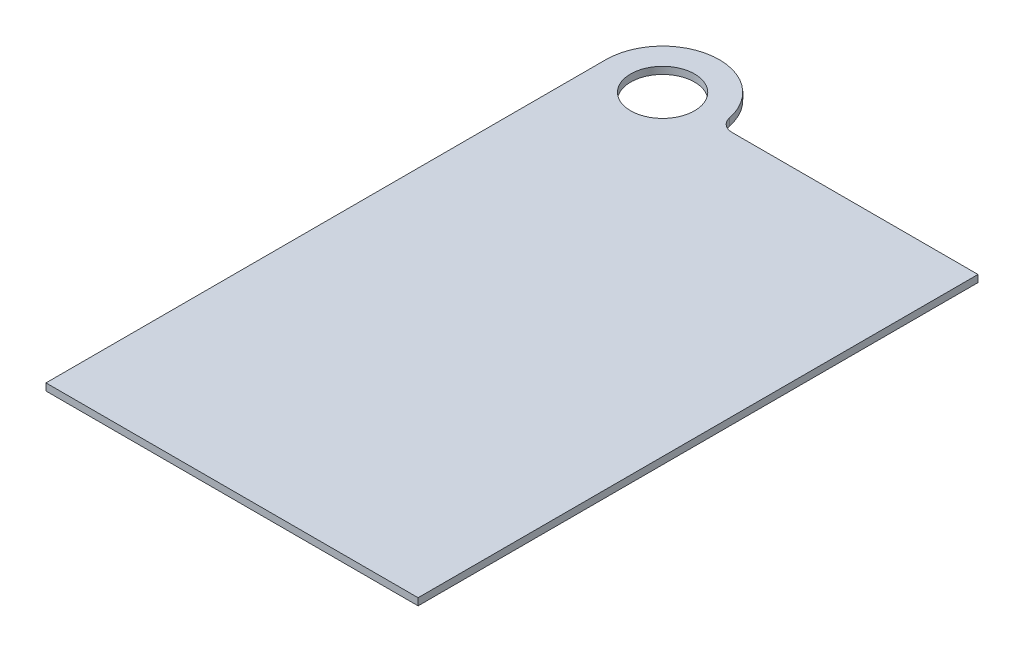
ISO-10303-21;
HEADER;
FILE_DESCRIPTION(('STEP AP214'),'2;1');
FILE_NAME('part.step','',(''),(''),'','','');
FILE_SCHEMA(('AUTOMOTIVE_DESIGN { 1 0 10303 214 1 1 1 1 }'));
ENDSEC;
DATA;
#1=APPLICATION_CONTEXT('core data for automotive mechanical design processes');
#2=APPLICATION_PROTOCOL_DEFINITION('international standard','automotive_design',2000,#1);
#3=PRODUCT_CONTEXT('',#1,'mechanical');
#4=PRODUCT('Part','Part','',(#3));
#5=PRODUCT_RELATED_PRODUCT_CATEGORY('part','',(#4));
#6=PRODUCT_DEFINITION_FORMATION('','',#4);
#7=PRODUCT_DEFINITION_CONTEXT('part definition',#1,'design');
#8=PRODUCT_DEFINITION('design','',#6,#7);
#9=PRODUCT_DEFINITION_SHAPE('','',#8);
#10=(LENGTH_UNIT() NAMED_UNIT(*) SI_UNIT(.MILLI.,.METRE.));
#11=(NAMED_UNIT(*) PLANE_ANGLE_UNIT() SI_UNIT($,.RADIAN.));
#12=(NAMED_UNIT(*) SI_UNIT($,.STERADIAN.) SOLID_ANGLE_UNIT());
#13=UNCERTAINTY_MEASURE_WITH_UNIT(LENGTH_MEASURE(1.E-05),#10,'distance_accuracy_value','');
#14=(GEOMETRIC_REPRESENTATION_CONTEXT(3) GLOBAL_UNCERTAINTY_ASSIGNED_CONTEXT((#13)) GLOBAL_UNIT_ASSIGNED_CONTEXT((#10,
#11,#12)) REPRESENTATION_CONTEXT('',''));
#15=CARTESIAN_POINT('',(0.,0.,0.));
#16=DIRECTION('',(0.,0.,1.));
#17=DIRECTION('',(1.,0.,0.));
#18=AXIS2_PLACEMENT_3D('',#15,#16,#17);
#19=CARTESIAN_POINT('',(0.,3.175,0.));
#20=DIRECTION('',(0.,1.,0.));
#21=DIRECTION('',(0.,0.,1.));
#22=AXIS2_PLACEMENT_3D('',#19,#20,#21);
#23=PLANE('',#22);
#24=DIRECTION('',(-1.,0.,0.));
#25=VECTOR('',#24,1.);
#26=CARTESIAN_POINT('',(25.4,3.175,0.));
#27=LINE('',#26,#25);
#28=CARTESIAN_POINT('',(141.2875,3.175,0.));
#29=VERTEX_POINT('',#28);
#30=CARTESIAN_POINT('',(31.1085197333464,3.175,0.));
#31=VERTEX_POINT('',#30);
#32=EDGE_CURVE('E128',#29,#31,#27,.T.);
#33=ORIENTED_EDGE('',*,*,#32,.T.);
#34=CARTESIAN_POINT('',(31.1085197333464,3.175,-6.35));
#35=DIRECTION('',(0.,1.,0.));
#36=DIRECTION('',(0.,0.,1.));
#37=AXIS2_PLACEMENT_3D('',#34,#35,#36);
#38=CIRCLE('',#37,6.35);
#39=CARTESIAN_POINT('',(24.8868157866771,3.175,-5.08));
#40=VERTEX_POINT('',#39);
#41=EDGE_CURVE('E11',#31,#40,#38,.F.);
#42=ORIENTED_EDGE('',*,*,#41,.T.);
#43=CARTESIAN_POINT('',(0.,3.175,0.));
#44=DIRECTION('',(0.,1.,0.));
#45=DIRECTION('',(0.,0.,1.));
#46=AXIS2_PLACEMENT_3D('',#43,#44,#45);
#47=CIRCLE('',#46,25.4);
#48=CARTESIAN_POINT('',(-25.4,3.175,0.));
#49=VERTEX_POINT('',#48);
#50=EDGE_CURVE('E92',#40,#49,#47,.T.);
#51=ORIENTED_EDGE('',*,*,#50,.T.);
#52=DIRECTION('',(0.,0.,1.));
#53=VECTOR('',#52,1.);
#54=CARTESIAN_POINT('',(-25.4,3.175,0.));
#55=LINE('',#54,#53);
#56=CARTESIAN_POINT('',(-25.4,3.175,250.825));
#57=VERTEX_POINT('',#56);
#58=EDGE_CURVE('E95',#49,#57,#55,.T.);
#59=ORIENTED_EDGE('',*,*,#58,.T.);
#60=DIRECTION('',(1.,0.,0.));
#61=VECTOR('',#60,1.);
#62=CARTESIAN_POINT('',(-25.4,3.175,250.825));
#63=LINE('',#62,#61);
#64=CARTESIAN_POINT('',(141.2875,3.175,250.825));
#65=VERTEX_POINT('',#64);
#66=EDGE_CURVE('E111',#57,#65,#63,.T.);
#67=ORIENTED_EDGE('',*,*,#66,.T.);
#68=DIRECTION('',(0.,0.,-1.));
#69=VECTOR('',#68,1.);
#70=CARTESIAN_POINT('',(141.2875,3.175,250.825));
#71=LINE('',#70,#69);
#72=EDGE_CURVE('E139',#65,#29,#71,.T.);
#73=ORIENTED_EDGE('',*,*,#72,.T.);
#74=EDGE_LOOP('',(#33,#42,#51,#59,#67,#73));
#75=FACE_BOUND('',#74,.T.);
#76=CARTESIAN_POINT('',(0.,3.175,0.));
#77=DIRECTION('',(0.,1.,0.));
#78=DIRECTION('',(0.,0.,1.));
#79=AXIS2_PLACEMENT_3D('',#76,#77,#78);
#80=CIRCLE('',#79,14.3129);
#81=CARTESIAN_POINT('',(0.,3.175,14.3129));
#82=VERTEX_POINT('',#81);
#83=EDGE_CURVE('E137',#82,#82,#80,.T.);
#84=ORIENTED_EDGE('',*,*,#83,.F.);
#85=EDGE_LOOP('',(#84));
#86=FACE_BOUND('',#85,.T.);
#87=ADVANCED_FACE('F40',(#75,#86),#23,.T.);
#88=CARTESIAN_POINT('',(0.,0.,0.));
#89=DIRECTION('',(0.,1.,0.));
#90=DIRECTION('',(0.,0.,1.));
#91=AXIS2_PLACEMENT_3D('',#88,#89,#90);
#92=PLANE('',#91);
#93=CARTESIAN_POINT('',(0.,0.,0.));
#94=DIRECTION('',(0.,1.,0.));
#95=DIRECTION('',(0.,0.,1.));
#96=AXIS2_PLACEMENT_3D('',#93,#94,#95);
#97=CIRCLE('',#96,25.4);
#98=CARTESIAN_POINT('',(24.8868157866771,0.,-5.08));
#99=VERTEX_POINT('',#98);
#100=CARTESIAN_POINT('',(-25.4,0.,0.));
#101=VERTEX_POINT('',#100);
#102=EDGE_CURVE('E114',#99,#101,#97,.T.);
#103=ORIENTED_EDGE('',*,*,#102,.F.);
#104=CARTESIAN_POINT('',(31.1085197333464,0.,-6.35));
#105=DIRECTION('',(0.,1.,0.));
#106=DIRECTION('',(0.,0.,1.));
#107=AXIS2_PLACEMENT_3D('',#104,#105,#106);
#108=CIRCLE('',#107,6.35);
#109=CARTESIAN_POINT('',(31.1085197333464,0.,0.));
#110=VERTEX_POINT('',#109);
#111=EDGE_CURVE('E48',#99,#110,#108,.T.);
#112=ORIENTED_EDGE('',*,*,#111,.T.);
#113=DIRECTION('',(-1.,0.,0.));
#114=VECTOR('',#113,1.);
#115=CARTESIAN_POINT('',(25.4,0.,0.));
#116=LINE('',#115,#114);
#117=CARTESIAN_POINT('',(141.2875,0.,0.));
#118=VERTEX_POINT('',#117);
#119=EDGE_CURVE('E102',#118,#110,#116,.T.);
#120=ORIENTED_EDGE('',*,*,#119,.F.);
#121=DIRECTION('',(0.,0.,-1.));
#122=VECTOR('',#121,1.);
#123=CARTESIAN_POINT('',(141.2875,0.,250.825));
#124=LINE('',#123,#122);
#125=CARTESIAN_POINT('',(141.2875,0.,250.825));
#126=VERTEX_POINT('',#125);
#127=EDGE_CURVE('E130',#126,#118,#124,.T.);
#128=ORIENTED_EDGE('',*,*,#127,.F.);
#129=DIRECTION('',(1.,0.,0.));
#130=VECTOR('',#129,1.);
#131=CARTESIAN_POINT('',(-25.4,0.,250.825));
#132=LINE('',#131,#130);
#133=CARTESIAN_POINT('',(-25.4,0.,250.825));
#134=VERTEX_POINT('',#133);
#135=EDGE_CURVE('E132',#134,#126,#132,.T.);
#136=ORIENTED_EDGE('',*,*,#135,.F.);
#137=DIRECTION('',(0.,0.,1.));
#138=VECTOR('',#137,1.);
#139=CARTESIAN_POINT('',(-25.4,0.,0.));
#140=LINE('',#139,#138);
#141=EDGE_CURVE('E134',#101,#134,#140,.T.);
#142=ORIENTED_EDGE('',*,*,#141,.F.);
#143=EDGE_LOOP('',(#103,#112,#120,#128,#136,#142));
#144=FACE_BOUND('',#143,.T.);
#145=CARTESIAN_POINT('',(0.,0.,0.));
#146=DIRECTION('',(0.,1.,0.));
#147=DIRECTION('',(0.,0.,1.));
#148=AXIS2_PLACEMENT_3D('',#145,#146,#147);
#149=CIRCLE('',#148,14.3129);
#150=CARTESIAN_POINT('',(0.,0.,14.3129));
#151=VERTEX_POINT('',#150);
#152=EDGE_CURVE('E142',#151,#151,#149,.T.);
#153=ORIENTED_EDGE('',*,*,#152,.T.);
#154=EDGE_LOOP('',(#153));
#155=FACE_BOUND('',#154,.T.);
#156=ADVANCED_FACE('F151',(#144,#155),#92,.F.);
#157=CARTESIAN_POINT('',(0.,3.175,0.));
#158=DIRECTION('',(0.,-1.,0.));
#159=DIRECTION('',(0.,0.,-1.));
#160=AXIS2_PLACEMENT_3D('',#157,#158,#159);
#161=CYLINDRICAL_SURFACE('',#160,25.4);
#162=ORIENTED_EDGE('',*,*,#50,.F.);
#163=DIRECTION('',(0.,-1.,0.));
#164=VECTOR('',#163,1.);
#165=CARTESIAN_POINT('',(24.8868157866771,3.175,-5.08));
#166=LINE('',#165,#164);
#167=EDGE_CURVE('E116',#40,#99,#166,.T.);
#168=ORIENTED_EDGE('',*,*,#167,.T.);
#169=ORIENTED_EDGE('',*,*,#102,.T.);
#170=DIRECTION('',(0.,-1.,0.));
#171=VECTOR('',#170,1.);
#172=CARTESIAN_POINT('',(-25.4,3.175,0.));
#173=LINE('',#172,#171);
#174=EDGE_CURVE('E107',#49,#101,#173,.T.);
#175=ORIENTED_EDGE('',*,*,#174,.F.);
#176=EDGE_LOOP('',(#162,#168,#169,#175));
#177=FACE_BOUND('',#176,.T.);
#178=ADVANCED_FACE('F113',(#177),#161,.T.);
#179=CARTESIAN_POINT('',(-25.4,3.175,0.));
#180=DIRECTION('',(1.,0.,0.));
#181=DIRECTION('',(0.,0.,-1.));
#182=AXIS2_PLACEMENT_3D('',#179,#180,#181);
#183=PLANE('',#182);
#184=ORIENTED_EDGE('',*,*,#141,.T.);
#185=DIRECTION('',(0.,-1.,0.));
#186=VECTOR('',#185,1.);
#187=CARTESIAN_POINT('',(-25.4,3.175,250.825));
#188=LINE('',#187,#186);
#189=EDGE_CURVE('E109',#57,#134,#188,.T.);
#190=ORIENTED_EDGE('',*,*,#189,.F.);
#191=ORIENTED_EDGE('',*,*,#58,.F.);
#192=ORIENTED_EDGE('',*,*,#174,.T.);
#193=EDGE_LOOP('',(#184,#190,#191,#192));
#194=FACE_BOUND('',#193,.T.);
#195=ADVANCED_FACE('F106',(#194),#183,.F.);
#196=CARTESIAN_POINT('',(-25.4,3.175,250.825));
#197=DIRECTION('',(0.,0.,-1.));
#198=DIRECTION('',(-1.,0.,0.));
#199=AXIS2_PLACEMENT_3D('',#196,#197,#198);
#200=PLANE('',#199);
#201=ORIENTED_EDGE('',*,*,#135,.T.);
#202=DIRECTION('',(0.,-1.,0.));
#203=VECTOR('',#202,1.);
#204=CARTESIAN_POINT('',(141.2875,3.175,250.825));
#205=LINE('',#204,#203);
#206=EDGE_CURVE('E119',#65,#126,#205,.T.);
#207=ORIENTED_EDGE('',*,*,#206,.F.);
#208=ORIENTED_EDGE('',*,*,#66,.F.);
#209=ORIENTED_EDGE('',*,*,#189,.T.);
#210=EDGE_LOOP('',(#201,#207,#208,#209));
#211=FACE_BOUND('',#210,.T.);
#212=ADVANCED_FACE('F166',(#211),#200,.F.);
#213=CARTESIAN_POINT('',(141.2875,3.175,250.825));
#214=DIRECTION('',(-1.,0.,0.));
#215=DIRECTION('',(0.,0.,1.));
#216=AXIS2_PLACEMENT_3D('',#213,#214,#215);
#217=PLANE('',#216);
#218=ORIENTED_EDGE('',*,*,#127,.T.);
#219=DIRECTION('',(0.,-1.,0.));
#220=VECTOR('',#219,1.);
#221=CARTESIAN_POINT('',(141.2875,3.175,0.));
#222=LINE('',#221,#220);
#223=EDGE_CURVE('E125',#29,#118,#222,.T.);
#224=ORIENTED_EDGE('',*,*,#223,.F.);
#225=ORIENTED_EDGE('',*,*,#72,.F.);
#226=ORIENTED_EDGE('',*,*,#206,.T.);
#227=EDGE_LOOP('',(#218,#224,#225,#226));
#228=FACE_BOUND('',#227,.T.);
#229=ADVANCED_FACE('F163',(#228),#217,.F.);
#230=CARTESIAN_POINT('',(25.4,3.175,0.));
#231=DIRECTION('',(0.,0.,1.));
#232=DIRECTION('',(1.,0.,0.));
#233=AXIS2_PLACEMENT_3D('',#230,#231,#232);
#234=PLANE('',#233);
#235=ORIENTED_EDGE('',*,*,#119,.T.);
#236=DIRECTION('',(0.,1.,0.));
#237=VECTOR('',#236,1.);
#238=CARTESIAN_POINT('',(31.1085197333464,3.175,0.));
#239=LINE('',#238,#237);
#240=EDGE_CURVE('E55',#110,#31,#239,.T.);
#241=ORIENTED_EDGE('',*,*,#240,.T.);
#242=ORIENTED_EDGE('',*,*,#32,.F.);
#243=ORIENTED_EDGE('',*,*,#223,.T.);
#244=EDGE_LOOP('',(#235,#241,#242,#243));
#245=FACE_BOUND('',#244,.T.);
#246=ADVANCED_FACE('F160',(#245),#234,.F.);
#247=CARTESIAN_POINT('',(0.,3.175,0.));
#248=DIRECTION('',(0.,-1.,0.));
#249=DIRECTION('',(0.,0.,-1.));
#250=AXIS2_PLACEMENT_3D('',#247,#248,#249);
#251=CYLINDRICAL_SURFACE('',#250,14.3129);
#252=ORIENTED_EDGE('',*,*,#83,.T.);
#253=EDGE_LOOP('',(#252));
#254=FACE_BOUND('',#253,.T.);
#255=ORIENTED_EDGE('',*,*,#152,.F.);
#256=EDGE_LOOP('',(#255));
#257=FACE_BOUND('',#256,.T.);
#258=ADVANCED_FACE('F148',(#254,#257),#251,.F.);
#259=CARTESIAN_POINT('',(31.1085197333464,3.175,-6.35));
#260=DIRECTION('',(0.,-1.,0.));
#261=DIRECTION('',(0.,0.,-1.));
#262=AXIS2_PLACEMENT_3D('',#259,#260,#261);
#263=CYLINDRICAL_SURFACE('',#262,6.35);
#264=ORIENTED_EDGE('',*,*,#41,.F.);
#265=ORIENTED_EDGE('',*,*,#240,.F.);
#266=ORIENTED_EDGE('',*,*,#111,.F.);
#267=ORIENTED_EDGE('',*,*,#167,.F.);
#268=EDGE_LOOP('',(#264,#265,#266,#267));
#269=FACE_BOUND('',#268,.T.);
#270=ADVANCED_FACE('F42',(#269),#263,.F.);
#271=CLOSED_SHELL('',(#87,#156,#178,#195,#212,#229,#246,#258,#270));
#272=MANIFOLD_SOLID_BREP('B2',#271);
#273=ADVANCED_BREP_SHAPE_REPRESENTATION('',(#18,#272),#14);
#274=SHAPE_DEFINITION_REPRESENTATION(#9,#273);
ENDSEC;
END-ISO-10303-21;
